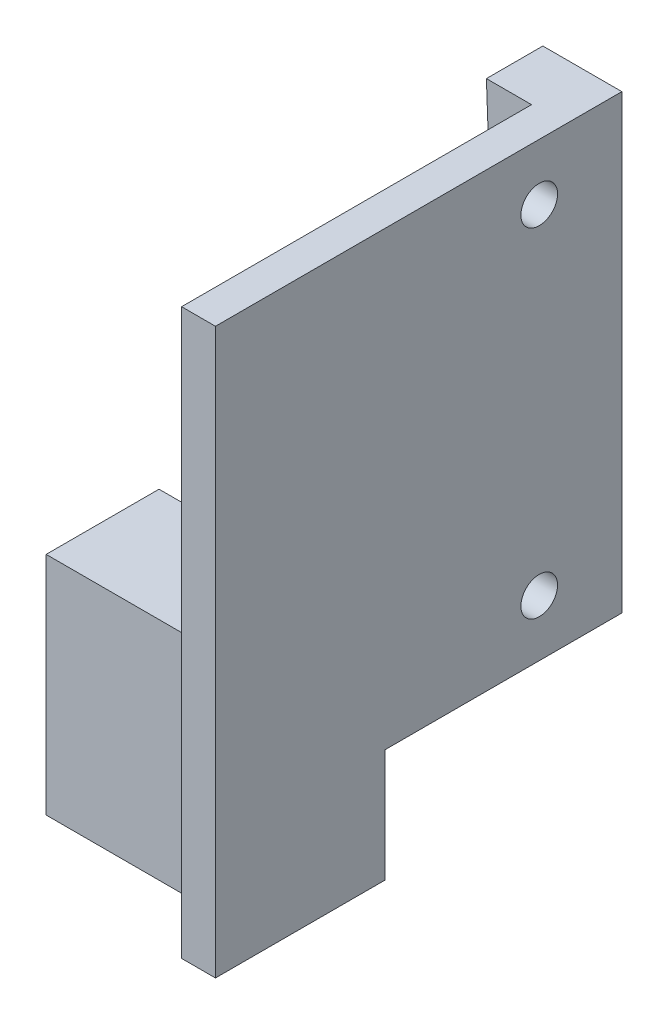
ISO-10303-21;
HEADER;
FILE_DESCRIPTION(('STEP AP214'),'2;1');
FILE_NAME('part.step','',(''),(''),'','','');
FILE_SCHEMA(('AUTOMOTIVE_DESIGN { 1 0 10303 214 1 1 1 1 }'));
ENDSEC;
DATA;
#1=APPLICATION_CONTEXT('core data for automotive mechanical design processes');
#2=APPLICATION_PROTOCOL_DEFINITION('international standard','automotive_design',2000,#1);
#3=PRODUCT_CONTEXT('',#1,'mechanical');
#4=PRODUCT('Part','Part','',(#3));
#5=PRODUCT_RELATED_PRODUCT_CATEGORY('part','',(#4));
#6=PRODUCT_DEFINITION_FORMATION('','',#4);
#7=PRODUCT_DEFINITION_CONTEXT('part definition',#1,'design');
#8=PRODUCT_DEFINITION('design','',#6,#7);
#9=PRODUCT_DEFINITION_SHAPE('','',#8);
#10=(LENGTH_UNIT() NAMED_UNIT(*) SI_UNIT(.MILLI.,.METRE.));
#11=(NAMED_UNIT(*) PLANE_ANGLE_UNIT() SI_UNIT($,.RADIAN.));
#12=(NAMED_UNIT(*) SI_UNIT($,.STERADIAN.) SOLID_ANGLE_UNIT());
#13=UNCERTAINTY_MEASURE_WITH_UNIT(LENGTH_MEASURE(1.E-05),#10,'distance_accuracy_value','');
#14=(GEOMETRIC_REPRESENTATION_CONTEXT(3) GLOBAL_UNCERTAINTY_ASSIGNED_CONTEXT((#13)) GLOBAL_UNIT_ASSIGNED_CONTEXT((#10,
#11,#12)) REPRESENTATION_CONTEXT('',''));
#15=CARTESIAN_POINT('',(0.,0.,0.));
#16=DIRECTION('',(0.,0.,1.));
#17=DIRECTION('',(1.,0.,0.));
#18=AXIS2_PLACEMENT_3D('',#15,#16,#17);
#19=CARTESIAN_POINT('',(4.00000000000001,-40.,11.));
#20=DIRECTION('',(1.,0.,0.));
#21=DIRECTION('',(0.,0.,-1.));
#22=AXIS2_PLACEMENT_3D('',#19,#20,#21);
#23=PLANE('',#22);
#24=CARTESIAN_POINT('',(4.00000000000001,-5.,7.32081576722976));
#25=DIRECTION('',(-1.,0.,0.));
#26=DIRECTION('',(0.,0.,1.));
#27=AXIS2_PLACEMENT_3D('',#24,#25,#26);
#28=CIRCLE('',#27,1.625);
#29=CARTESIAN_POINT('',(4.00000000000001,-5.,8.94581576722976));
#30=VERTEX_POINT('',#29);
#31=EDGE_CURVE('E173',#30,#30,#28,.T.);
#32=ORIENTED_EDGE('',*,*,#31,.F.);
#33=EDGE_LOOP('',(#32));
#34=FACE_BOUND('',#33,.T.);
#35=CARTESIAN_POINT('',(4.00000000000001,-35.,7.32081576722976));
#36=DIRECTION('',(-1.,0.,0.));
#37=DIRECTION('',(0.,0.,1.));
#38=AXIS2_PLACEMENT_3D('',#35,#36,#37);
#39=CIRCLE('',#38,1.625);
#40=CARTESIAN_POINT('',(4.00000000000001,-35.,8.94581576722976));
#41=VERTEX_POINT('',#40);
#42=EDGE_CURVE('E178',#41,#41,#39,.T.);
#43=ORIENTED_EDGE('',*,*,#42,.F.);
#44=EDGE_LOOP('',(#43));
#45=FACE_BOUND('',#44,.T.);
#46=DIRECTION('',(0.,-1.,0.));
#47=VECTOR('',#46,1.);
#48=CARTESIAN_POINT('',(4.00000000000001,-30.,21.));
#49=LINE('',#48,#47);
#50=CARTESIAN_POINT('',(4.00000000000001,-30.,21.));
#51=VERTEX_POINT('',#50);
#52=CARTESIAN_POINT('',(4.00000000000001,-40.,21.));
#53=VERTEX_POINT('',#52);
#54=EDGE_CURVE('E156',#51,#53,#49,.T.);
#55=ORIENTED_EDGE('',*,*,#54,.F.);
#56=DIRECTION('',(0.,0.,-1.));
#57=VECTOR('',#56,1.);
#58=CARTESIAN_POINT('',(4.00000000000001,-30.,21.));
#59=LINE('',#58,#57);
#60=CARTESIAN_POINT('',(4.00000000000001,-30.,31.));
#61=VERTEX_POINT('',#60);
#62=EDGE_CURVE('E145',#61,#51,#59,.T.);
#63=ORIENTED_EDGE('',*,*,#62,.F.);
#64=DIRECTION('',(0.,1.,0.));
#65=VECTOR('',#64,1.);
#66=CARTESIAN_POINT('',(4.00000000000001,-30.,31.));
#67=LINE('',#66,#65);
#68=CARTESIAN_POINT('',(4.00000000000001,-50.,31.));
#69=VERTEX_POINT('',#68);
#70=EDGE_CURVE('E147',#69,#61,#67,.T.);
#71=ORIENTED_EDGE('',*,*,#70,.F.);
#72=DIRECTION('',(0.,0.,-1.));
#73=VECTOR('',#72,1.);
#74=CARTESIAN_POINT('',(4.00000000000001,-50.,36.));
#75=LINE('',#74,#73);
#76=CARTESIAN_POINT('',(4.00000000000001,-50.,36.));
#77=VERTEX_POINT('',#76);
#78=EDGE_CURVE('E130',#77,#69,#75,.T.);
#79=ORIENTED_EDGE('',*,*,#78,.F.);
#80=DIRECTION('',(0.,-1.,0.));
#81=VECTOR('',#80,1.);
#82=CARTESIAN_POINT('',(4.00000000000001,0.,36.));
#83=LINE('',#82,#81);
#84=CARTESIAN_POINT('',(4.00000000000001,0.,36.));
#85=VERTEX_POINT('',#84);
#86=EDGE_CURVE('E191',#85,#77,#83,.T.);
#87=ORIENTED_EDGE('',*,*,#86,.F.);
#88=DIRECTION('',(0.,0.,-1.));
#89=VECTOR('',#88,1.);
#90=CARTESIAN_POINT('',(4.00000000000001,0.,11.));
#91=LINE('',#90,#89);
#92=CARTESIAN_POINT('',(4.00000000000001,0.,5.));
#93=VERTEX_POINT('',#92);
#94=EDGE_CURVE('E196',#85,#93,#91,.T.);
#95=ORIENTED_EDGE('',*,*,#94,.T.);
#96=DIRECTION('',(0.,-1.,0.));
#97=VECTOR('',#96,1.);
#98=CARTESIAN_POINT('',(4.00000000000001,-40.,5.));
#99=LINE('',#98,#97);
#100=CARTESIAN_POINT('',(4.00000000000001,-40.,5.));
#101=VERTEX_POINT('',#100);
#102=EDGE_CURVE('E48',#93,#101,#99,.T.);
#103=ORIENTED_EDGE('',*,*,#102,.T.);
#104=DIRECTION('',(0.,0.,-1.));
#105=VECTOR('',#104,1.);
#106=CARTESIAN_POINT('',(4.00000000000001,-40.,11.));
#107=LINE('',#106,#105);
#108=EDGE_CURVE('E194',#53,#101,#107,.T.);
#109=ORIENTED_EDGE('',*,*,#108,.F.);
#110=EDGE_LOOP('',(#55,#63,#71,#79,#87,#95,#103,#109));
#111=FACE_BOUND('',#110,.T.);
#112=ADVANCED_FACE('F33',(#34,#45,#111),#23,.F.);
#113=CARTESIAN_POINT('',(0.,-40.,5.));
#114=DIRECTION('',(0.,1.,0.));
#115=DIRECTION('',(0.,0.,1.));
#116=AXIS2_PLACEMENT_3D('',#113,#114,#115);
#117=PLANE('',#116);
#118=DIRECTION('',(1.,0.,0.));
#119=VECTOR('',#118,1.);
#120=CARTESIAN_POINT('',(4.00000000000001,-40.,21.));
#121=LINE('',#120,#119);
#122=CARTESIAN_POINT('',(7.00000000000001,-40.,21.));
#123=VERTEX_POINT('',#122);
#124=EDGE_CURVE('E165',#53,#123,#121,.T.);
#125=ORIENTED_EDGE('',*,*,#124,.F.);
#126=ORIENTED_EDGE('',*,*,#108,.T.);
#127=DIRECTION('',(1.,0.,0.));
#128=VECTOR('',#127,1.);
#129=CARTESIAN_POINT('',(0.,-40.,5.));
#130=LINE('',#129,#128);
#131=CARTESIAN_POINT('',(1.50000000000001,-40.,5.));
#132=VERTEX_POINT('',#131);
#133=EDGE_CURVE('E206',#132,#101,#130,.T.);
#134=ORIENTED_EDGE('',*,*,#133,.F.);
#135=DIRECTION('',(0.,0.,1.));
#136=VECTOR('',#135,1.);
#137=CARTESIAN_POINT('',(1.50000000000001,-40.,0.));
#138=LINE('',#137,#136);
#139=CARTESIAN_POINT('',(1.50000000000001,-40.,0.));
#140=VERTEX_POINT('',#139);
#141=EDGE_CURVE('E202',#140,#132,#138,.T.);
#142=ORIENTED_EDGE('',*,*,#141,.F.);
#143=DIRECTION('',(1.,0.,0.));
#144=VECTOR('',#143,1.);
#145=CARTESIAN_POINT('',(0.,-40.,0.));
#146=LINE('',#145,#144);
#147=CARTESIAN_POINT('',(7.00000000000001,-40.,0.));
#148=VERTEX_POINT('',#147);
#149=EDGE_CURVE('E205',#140,#148,#146,.T.);
#150=ORIENTED_EDGE('',*,*,#149,.T.);
#151=DIRECTION('',(0.,0.,-1.));
#152=VECTOR('',#151,1.);
#153=CARTESIAN_POINT('',(7.00000000000001,-40.,5.));
#154=LINE('',#153,#152);
#155=EDGE_CURVE('E11',#123,#148,#154,.T.);
#156=ORIENTED_EDGE('',*,*,#155,.F.);
#157=EDGE_LOOP('',(#125,#126,#134,#142,#150,#156));
#158=FACE_BOUND('',#157,.T.);
#159=ADVANCED_FACE('F35',(#158),#117,.F.);
#160=CARTESIAN_POINT('',(7.,0.,5.));
#161=DIRECTION('',(-1.,0.,0.));
#162=DIRECTION('',(0.,-1.,0.));
#163=AXIS2_PLACEMENT_3D('',#160,#161,#162);
#164=PLANE('',#163);
#165=CARTESIAN_POINT('',(7.00000000000001,-35.,7.32081576722976));
#166=DIRECTION('',(-1.,0.,0.));
#167=DIRECTION('',(0.,0.,1.));
#168=AXIS2_PLACEMENT_3D('',#165,#166,#167);
#169=CIRCLE('',#168,1.625);
#170=CARTESIAN_POINT('',(7.00000000000001,-35.,8.94581576722976));
#171=VERTEX_POINT('',#170);
#172=EDGE_CURVE('E174',#171,#171,#169,.T.);
#173=ORIENTED_EDGE('',*,*,#172,.T.);
#174=EDGE_LOOP('',(#173));
#175=FACE_BOUND('',#174,.T.);
#176=CARTESIAN_POINT('',(7.00000000000001,-5.,7.32081576722976));
#177=DIRECTION('',(-1.,0.,0.));
#178=DIRECTION('',(0.,0.,1.));
#179=AXIS2_PLACEMENT_3D('',#176,#177,#178);
#180=CIRCLE('',#179,1.625);
#181=CARTESIAN_POINT('',(7.00000000000001,-5.,8.94581576722976));
#182=VERTEX_POINT('',#181);
#183=EDGE_CURVE('E181',#182,#182,#180,.T.);
#184=ORIENTED_EDGE('',*,*,#183,.T.);
#185=EDGE_LOOP('',(#184));
#186=FACE_BOUND('',#185,.T.);
#187=DIRECTION('',(0.,1.,0.));
#188=VECTOR('',#187,1.);
#189=CARTESIAN_POINT('',(7.,0.,0.));
#190=LINE('',#189,#188);
#191=CARTESIAN_POINT('',(7.,0.,0.));
#192=VERTEX_POINT('',#191);
#193=EDGE_CURVE('E213',#148,#192,#190,.T.);
#194=ORIENTED_EDGE('',*,*,#193,.T.);
#195=DIRECTION('',(0.,0.,-1.));
#196=VECTOR('',#195,1.);
#197=CARTESIAN_POINT('',(7.,0.,5.));
#198=LINE('',#197,#196);
#199=CARTESIAN_POINT('',(7.00000000000001,0.,36.));
#200=VERTEX_POINT('',#199);
#201=EDGE_CURVE('E41',#200,#192,#198,.T.);
#202=ORIENTED_EDGE('',*,*,#201,.F.);
#203=DIRECTION('',(0.,1.,0.));
#204=VECTOR('',#203,1.);
#205=CARTESIAN_POINT('',(7.00000000000001,0.,36.));
#206=LINE('',#205,#204);
#207=CARTESIAN_POINT('',(7.00000000000001,-50.,36.));
#208=VERTEX_POINT('',#207);
#209=EDGE_CURVE('E177',#208,#200,#206,.T.);
#210=ORIENTED_EDGE('',*,*,#209,.F.);
#211=DIRECTION('',(0.,0.,1.));
#212=VECTOR('',#211,1.);
#213=CARTESIAN_POINT('',(7.00000000000001,-50.,36.));
#214=LINE('',#213,#212);
#215=CARTESIAN_POINT('',(7.00000000000001,-50.,21.));
#216=VERTEX_POINT('',#215);
#217=EDGE_CURVE('E129',#216,#208,#214,.T.);
#218=ORIENTED_EDGE('',*,*,#217,.F.);
#219=DIRECTION('',(0.,1.,0.));
#220=VECTOR('',#219,1.);
#221=CARTESIAN_POINT('',(7.00000000000001,-50.,21.));
#222=LINE('',#221,#220);
#223=EDGE_CURVE('E125',#216,#123,#222,.T.);
#224=ORIENTED_EDGE('',*,*,#223,.T.);
#225=ORIENTED_EDGE('',*,*,#155,.T.);
#226=EDGE_LOOP('',(#194,#202,#210,#218,#224,#225));
#227=FACE_BOUND('',#226,.T.);
#228=ADVANCED_FACE('F242',(#175,#186,#227),#164,.F.);
#229=CARTESIAN_POINT('',(0.,0.,5.));
#230=DIRECTION('',(0.,-1.,0.));
#231=DIRECTION('',(0.,0.,-1.));
#232=AXIS2_PLACEMENT_3D('',#229,#230,#231);
#233=PLANE('',#232);
#234=DIRECTION('',(-1.,0.,0.));
#235=VECTOR('',#234,1.);
#236=CARTESIAN_POINT('',(0.,0.,0.));
#237=LINE('',#236,#235);
#238=CARTESIAN_POINT('',(0.,0.,0.));
#239=VERTEX_POINT('',#238);
#240=EDGE_CURVE('E209',#192,#239,#237,.T.);
#241=ORIENTED_EDGE('',*,*,#240,.T.);
#242=DIRECTION('',(0.,0.,-1.));
#243=VECTOR('',#242,1.);
#244=CARTESIAN_POINT('',(0.,0.,5.));
#245=LINE('',#244,#243);
#246=CARTESIAN_POINT('',(0.,0.,5.));
#247=VERTEX_POINT('',#246);
#248=EDGE_CURVE('E56',#247,#239,#245,.T.);
#249=ORIENTED_EDGE('',*,*,#248,.F.);
#250=DIRECTION('',(-1.,0.,0.));
#251=VECTOR('',#250,1.);
#252=CARTESIAN_POINT('',(0.,0.,5.));
#253=LINE('',#252,#251);
#254=EDGE_CURVE('E208',#93,#247,#253,.T.);
#255=ORIENTED_EDGE('',*,*,#254,.F.);
#256=ORIENTED_EDGE('',*,*,#94,.F.);
#257=DIRECTION('',(-1.,0.,0.));
#258=VECTOR('',#257,1.);
#259=CARTESIAN_POINT('',(7.00000000000001,0.,36.));
#260=LINE('',#259,#258);
#261=EDGE_CURVE('E188',#200,#85,#260,.T.);
#262=ORIENTED_EDGE('',*,*,#261,.F.);
#263=ORIENTED_EDGE('',*,*,#201,.T.);
#264=EDGE_LOOP('',(#241,#249,#255,#256,#262,#263));
#265=FACE_BOUND('',#264,.T.);
#266=ADVANCED_FACE('F221',(#265),#233,.F.);
#267=CARTESIAN_POINT('',(0.,0.,5.));
#268=DIRECTION('',(0.,0.,1.));
#269=DIRECTION('',(1.,0.,0.));
#270=AXIS2_PLACEMENT_3D('',#267,#268,#269);
#271=PLANE('',#270);
#272=ORIENTED_EDGE('',*,*,#102,.F.);
#273=ORIENTED_EDGE('',*,*,#254,.T.);
#274=DIRECTION('',(-0.0374736605890944,0.999297615709181,0.));
#275=VECTOR('',#274,1.);
#276=CARTESIAN_POINT('',(0.,0.,5.));
#277=LINE('',#276,#275);
#278=EDGE_CURVE('E199',#132,#247,#277,.T.);
#279=ORIENTED_EDGE('',*,*,#278,.F.);
#280=ORIENTED_EDGE('',*,*,#133,.T.);
#281=EDGE_LOOP('',(#272,#273,#279,#280));
#282=FACE_BOUND('',#281,.T.);
#283=ADVANCED_FACE('F234',(#282),#271,.T.);
#284=CARTESIAN_POINT('',(0.,0.,0.));
#285=DIRECTION('',(0.,0.,1.));
#286=DIRECTION('',(1.,0.,0.));
#287=AXIS2_PLACEMENT_3D('',#284,#285,#286);
#288=PLANE('',#287);
#289=ORIENTED_EDGE('',*,*,#149,.F.);
#290=DIRECTION('',(-0.0374736605890944,0.999297615709181,0.));
#291=VECTOR('',#290,1.);
#292=CARTESIAN_POINT('',(0.,0.,0.));
#293=LINE('',#292,#291);
#294=EDGE_CURVE('E200',#140,#239,#293,.T.);
#295=ORIENTED_EDGE('',*,*,#294,.T.);
#296=ORIENTED_EDGE('',*,*,#240,.F.);
#297=ORIENTED_EDGE('',*,*,#193,.F.);
#298=EDGE_LOOP('',(#289,#295,#296,#297));
#299=FACE_BOUND('',#298,.T.);
#300=ADVANCED_FACE('F226',(#299),#288,.F.);
#301=CARTESIAN_POINT('',(0.,0.,0.));
#302=DIRECTION('',(0.999297615709181,0.0374736605890944,0.));
#303=DIRECTION('',(-0.0374736605890944,0.999297615709181,0.));
#304=AXIS2_PLACEMENT_3D('',#301,#302,#303);
#305=PLANE('',#304);
#306=ORIENTED_EDGE('',*,*,#278,.T.);
#307=ORIENTED_EDGE('',*,*,#248,.T.);
#308=ORIENTED_EDGE('',*,*,#294,.F.);
#309=ORIENTED_EDGE('',*,*,#141,.T.);
#310=EDGE_LOOP('',(#306,#307,#308,#309));
#311=FACE_BOUND('',#310,.T.);
#312=ADVANCED_FACE('F228',(#311),#305,.F.);
#313=CARTESIAN_POINT('',(0.,0.,36.));
#314=DIRECTION('',(0.,0.,-1.));
#315=DIRECTION('',(-1.,0.,0.));
#316=AXIS2_PLACEMENT_3D('',#313,#314,#315);
#317=PLANE('',#316);
#318=ORIENTED_EDGE('',*,*,#209,.T.);
#319=ORIENTED_EDGE('',*,*,#261,.T.);
#320=ORIENTED_EDGE('',*,*,#86,.T.);
#321=DIRECTION('',(-1.,0.,0.));
#322=VECTOR('',#321,1.);
#323=CARTESIAN_POINT('',(4.00000000000001,-50.,36.));
#324=LINE('',#323,#322);
#325=EDGE_CURVE('E168',#208,#77,#324,.T.);
#326=ORIENTED_EDGE('',*,*,#325,.F.);
#327=EDGE_LOOP('',(#318,#319,#320,#326));
#328=FACE_BOUND('',#327,.T.);
#329=ADVANCED_FACE('F240',(#328),#317,.F.);
#330=CARTESIAN_POINT('',(7.00000000000001,-5.,7.32081576722976));
#331=DIRECTION('',(-1.,0.,0.));
#332=DIRECTION('',(0.,0.,1.));
#333=AXIS2_PLACEMENT_3D('',#330,#331,#332);
#334=CYLINDRICAL_SURFACE('',#333,1.625);
#335=ORIENTED_EDGE('',*,*,#183,.F.);
#336=EDGE_LOOP('',(#335));
#337=FACE_BOUND('',#336,.T.);
#338=ORIENTED_EDGE('',*,*,#31,.T.);
#339=EDGE_LOOP('',(#338));
#340=FACE_BOUND('',#339,.T.);
#341=ADVANCED_FACE('F285',(#337,#340),#334,.F.);
#342=CARTESIAN_POINT('',(7.00000000000001,-35.,7.32081576722976));
#343=DIRECTION('',(-1.,0.,0.));
#344=DIRECTION('',(0.,0.,1.));
#345=AXIS2_PLACEMENT_3D('',#342,#343,#344);
#346=CYLINDRICAL_SURFACE('',#345,1.625);
#347=ORIENTED_EDGE('',*,*,#172,.F.);
#348=EDGE_LOOP('',(#347));
#349=FACE_BOUND('',#348,.T.);
#350=ORIENTED_EDGE('',*,*,#42,.T.);
#351=EDGE_LOOP('',(#350));
#352=FACE_BOUND('',#351,.T.);
#353=ADVANCED_FACE('F288',(#349,#352),#346,.F.);
#354=CARTESIAN_POINT('',(4.00000000000001,-50.,21.));
#355=DIRECTION('',(0.,0.,1.));
#356=DIRECTION('',(1.,0.,0.));
#357=AXIS2_PLACEMENT_3D('',#354,#355,#356);
#358=PLANE('',#357);
#359=CARTESIAN_POINT('',(-5.29999999999999,-44.1,21.));
#360=DIRECTION('',(0.,0.,-1.));
#361=DIRECTION('',(-1.,0.,0.));
#362=AXIS2_PLACEMENT_3D('',#359,#360,#361);
#363=CIRCLE('',#362,2.6);
#364=CARTESIAN_POINT('',(-7.89999999999999,-44.1,21.));
#365=VERTEX_POINT('',#364);
#366=EDGE_CURVE('E150',#365,#365,#363,.T.);
#367=ORIENTED_EDGE('',*,*,#366,.F.);
#368=EDGE_LOOP('',(#367));
#369=FACE_BOUND('',#368,.T.);
#370=ORIENTED_EDGE('',*,*,#124,.T.);
#371=ORIENTED_EDGE('',*,*,#223,.F.);
#372=DIRECTION('',(1.,0.,0.));
#373=VECTOR('',#372,1.);
#374=CARTESIAN_POINT('',(4.00000000000001,-50.,21.));
#375=LINE('',#374,#373);
#376=CARTESIAN_POINT('',(-13.,-50.,21.));
#377=VERTEX_POINT('',#376);
#378=EDGE_CURVE('E117',#377,#216,#375,.T.);
#379=ORIENTED_EDGE('',*,*,#378,.F.);
#380=DIRECTION('',(0.,-1.,0.));
#381=VECTOR('',#380,1.);
#382=CARTESIAN_POINT('',(-13.,-30.,21.));
#383=LINE('',#382,#381);
#384=CARTESIAN_POINT('',(-13.,-30.,21.));
#385=VERTEX_POINT('',#384);
#386=EDGE_CURVE('E123',#385,#377,#383,.T.);
#387=ORIENTED_EDGE('',*,*,#386,.F.);
#388=DIRECTION('',(1.,0.,0.));
#389=VECTOR('',#388,1.);
#390=CARTESIAN_POINT('',(-13.,-30.,21.));
#391=LINE('',#390,#389);
#392=EDGE_CURVE('E155',#385,#51,#391,.T.);
#393=ORIENTED_EDGE('',*,*,#392,.T.);
#394=ORIENTED_EDGE('',*,*,#54,.T.);
#395=EDGE_LOOP('',(#370,#371,#379,#387,#393,#394));
#396=FACE_BOUND('',#395,.T.);
#397=ADVANCED_FACE('F120',(#369,#396),#358,.F.);
#398=CARTESIAN_POINT('',(0.,-50.,0.));
#399=DIRECTION('',(0.,-1.,0.));
#400=DIRECTION('',(0.,0.,-1.));
#401=AXIS2_PLACEMENT_3D('',#398,#399,#400);
#402=PLANE('',#401);
#403=ORIENTED_EDGE('',*,*,#78,.T.);
#404=DIRECTION('',(1.,0.,0.));
#405=VECTOR('',#404,1.);
#406=CARTESIAN_POINT('',(-13.,-50.,31.));
#407=LINE('',#406,#405);
#408=CARTESIAN_POINT('',(-13.,-50.,31.));
#409=VERTEX_POINT('',#408);
#410=EDGE_CURVE('E136',#409,#69,#407,.T.);
#411=ORIENTED_EDGE('',*,*,#410,.F.);
#412=DIRECTION('',(0.,0.,1.));
#413=VECTOR('',#412,1.);
#414=CARTESIAN_POINT('',(-13.,-50.,21.));
#415=LINE('',#414,#413);
#416=EDGE_CURVE('E133',#377,#409,#415,.T.);
#417=ORIENTED_EDGE('',*,*,#416,.F.);
#418=ORIENTED_EDGE('',*,*,#378,.T.);
#419=ORIENTED_EDGE('',*,*,#217,.T.);
#420=ORIENTED_EDGE('',*,*,#325,.T.);
#421=EDGE_LOOP('',(#403,#411,#417,#418,#419,#420));
#422=FACE_BOUND('',#421,.T.);
#423=ADVANCED_FACE('F135',(#422),#402,.T.);
#424=CARTESIAN_POINT('',(-13.,-30.,31.));
#425=DIRECTION('',(0.,0.,-1.));
#426=DIRECTION('',(0.,1.,0.));
#427=AXIS2_PLACEMENT_3D('',#424,#425,#426);
#428=PLANE('',#427);
#429=ORIENTED_EDGE('',*,*,#70,.T.);
#430=DIRECTION('',(1.,0.,0.));
#431=VECTOR('',#430,1.);
#432=CARTESIAN_POINT('',(-13.,-30.,31.));
#433=LINE('',#432,#431);
#434=CARTESIAN_POINT('',(-13.,-30.,31.));
#435=VERTEX_POINT('',#434);
#436=EDGE_CURVE('E161',#435,#61,#433,.T.);
#437=ORIENTED_EDGE('',*,*,#436,.F.);
#438=DIRECTION('',(0.,1.,0.));
#439=VECTOR('',#438,1.);
#440=CARTESIAN_POINT('',(-13.,-30.,31.));
#441=LINE('',#440,#439);
#442=EDGE_CURVE('E139',#409,#435,#441,.T.);
#443=ORIENTED_EDGE('',*,*,#442,.F.);
#444=ORIENTED_EDGE('',*,*,#410,.T.);
#445=EDGE_LOOP('',(#429,#437,#443,#444));
#446=FACE_BOUND('',#445,.T.);
#447=ADVANCED_FACE('F247',(#446),#428,.F.);
#448=CARTESIAN_POINT('',(-13.,-30.,21.));
#449=DIRECTION('',(0.,-1.,0.));
#450=DIRECTION('',(0.,0.,-1.));
#451=AXIS2_PLACEMENT_3D('',#448,#449,#450);
#452=PLANE('',#451);
#453=ORIENTED_EDGE('',*,*,#62,.T.);
#454=ORIENTED_EDGE('',*,*,#392,.F.);
#455=DIRECTION('',(0.,0.,-1.));
#456=VECTOR('',#455,1.);
#457=CARTESIAN_POINT('',(-13.,-30.,21.));
#458=LINE('',#457,#456);
#459=EDGE_CURVE('E143',#435,#385,#458,.T.);
#460=ORIENTED_EDGE('',*,*,#459,.F.);
#461=ORIENTED_EDGE('',*,*,#436,.T.);
#462=EDGE_LOOP('',(#453,#454,#460,#461));
#463=FACE_BOUND('',#462,.T.);
#464=ADVANCED_FACE('F249',(#463),#452,.F.);
#465=CARTESIAN_POINT('',(-13.,0.,0.));
#466=DIRECTION('',(-1.,0.,0.));
#467=DIRECTION('',(0.,0.,1.));
#468=AXIS2_PLACEMENT_3D('',#465,#466,#467);
#469=PLANE('',#468);
#470=ORIENTED_EDGE('',*,*,#386,.T.);
#471=ORIENTED_EDGE('',*,*,#416,.T.);
#472=ORIENTED_EDGE('',*,*,#442,.T.);
#473=ORIENTED_EDGE('',*,*,#459,.T.);
#474=EDGE_LOOP('',(#470,#471,#472,#473));
#475=FACE_BOUND('',#474,.T.);
#476=ADVANCED_FACE('F141',(#475),#469,.T.);
#477=CARTESIAN_POINT('',(-5.29999999999999,-44.1,26.));
#478=DIRECTION('',(0.,0.,-1.));
#479=DIRECTION('',(-1.,0.,0.));
#480=AXIS2_PLACEMENT_3D('',#477,#478,#479);
#481=CYLINDRICAL_SURFACE('',#480,2.6);
#482=CARTESIAN_POINT('',(-5.29999999999999,-44.1,26.));
#483=DIRECTION('',(0.,0.,-1.));
#484=DIRECTION('',(-1.,0.,0.));
#485=AXIS2_PLACEMENT_3D('',#482,#483,#484);
#486=CIRCLE('',#485,2.6);
#487=CARTESIAN_POINT('',(-7.89999999999999,-44.1,26.));
#488=VERTEX_POINT('',#487);
#489=EDGE_CURVE('E158',#488,#488,#486,.T.);
#490=ORIENTED_EDGE('',*,*,#489,.F.);
#491=EDGE_LOOP('',(#490));
#492=FACE_BOUND('',#491,.T.);
#493=ORIENTED_EDGE('',*,*,#366,.T.);
#494=EDGE_LOOP('',(#493));
#495=FACE_BOUND('',#494,.T.);
#496=ADVANCED_FACE('F256',(#492,#495),#481,.F.);
#497=CARTESIAN_POINT('',(-5.29999999999999,-44.1,26.));
#498=DIRECTION('',(0.,0.,-1.));
#499=DIRECTION('',(-1.,0.,0.));
#500=AXIS2_PLACEMENT_3D('',#497,#498,#499);
#501=PLANE('',#500);
#502=ORIENTED_EDGE('',*,*,#489,.T.);
#503=EDGE_LOOP('',(#502));
#504=FACE_BOUND('',#503,.T.);
#505=ADVANCED_FACE('F334',(#504),#501,.T.);
#506=CLOSED_SHELL('',(#112,#159,#228,#266,#283,#300,#312,#329,#341,#353,#397,#423,#447,#464,
#476,#496,#505));
#507=MANIFOLD_SOLID_BREP('B2',#506);
#508=ADVANCED_BREP_SHAPE_REPRESENTATION('',(#18,#507),#14);
#509=SHAPE_DEFINITION_REPRESENTATION(#9,#508);
ENDSEC;
END-ISO-10303-21;
